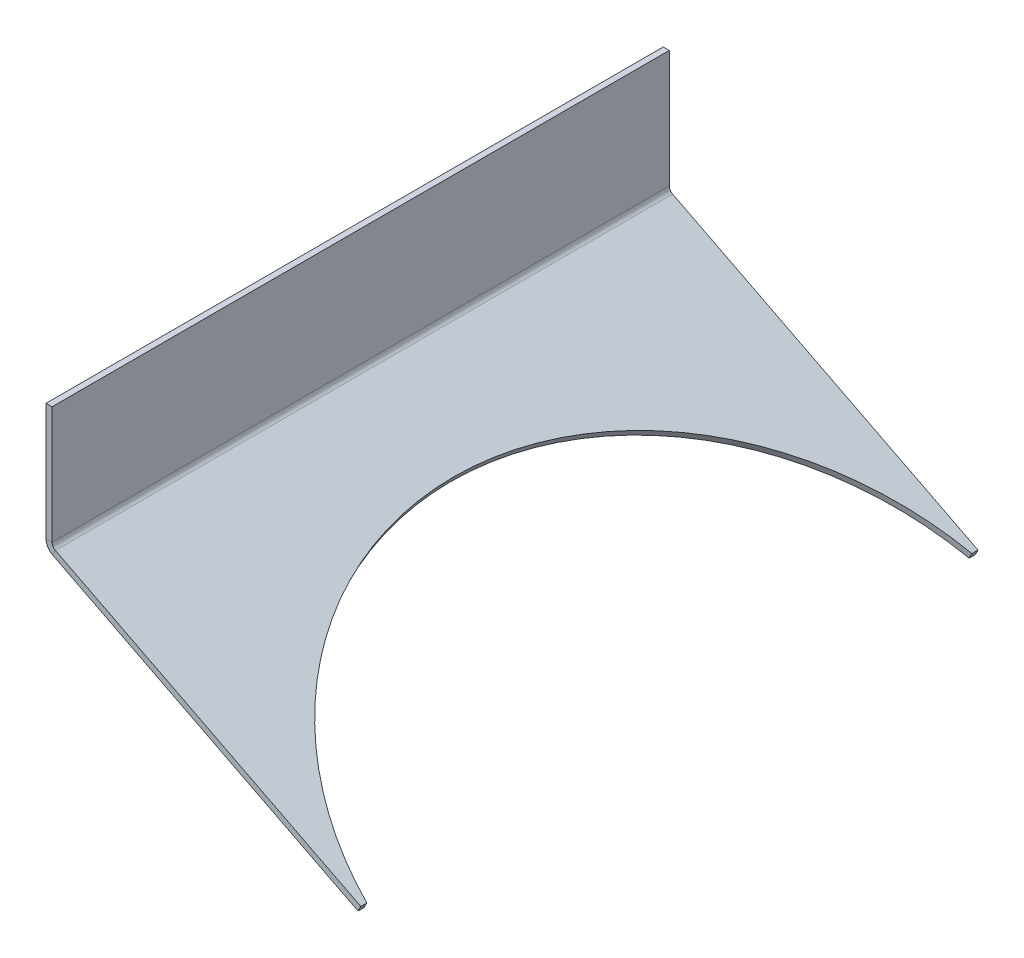
ISO-10303-21;
HEADER;
FILE_DESCRIPTION(('STEP AP214'),'2;1');
FILE_NAME('part.step','',(''),(''),'','','');
FILE_SCHEMA(('AUTOMOTIVE_DESIGN { 1 0 10303 214 1 1 1 1 }'));
ENDSEC;
DATA;
#1=APPLICATION_CONTEXT('core data for automotive mechanical design processes');
#2=APPLICATION_PROTOCOL_DEFINITION('international standard','automotive_design',2000,#1);
#3=PRODUCT_CONTEXT('',#1,'mechanical');
#4=PRODUCT('Part','Part','',(#3));
#5=PRODUCT_RELATED_PRODUCT_CATEGORY('part','',(#4));
#6=PRODUCT_DEFINITION_FORMATION('','',#4);
#7=PRODUCT_DEFINITION_CONTEXT('part definition',#1,'design');
#8=PRODUCT_DEFINITION('design','',#6,#7);
#9=PRODUCT_DEFINITION_SHAPE('','',#8);
#10=(LENGTH_UNIT() NAMED_UNIT(*) SI_UNIT(.MILLI.,.METRE.));
#11=(NAMED_UNIT(*) PLANE_ANGLE_UNIT() SI_UNIT($,.RADIAN.));
#12=(NAMED_UNIT(*) SI_UNIT($,.STERADIAN.) SOLID_ANGLE_UNIT());
#13=UNCERTAINTY_MEASURE_WITH_UNIT(LENGTH_MEASURE(1.E-05),#10,'distance_accuracy_value','');
#14=(GEOMETRIC_REPRESENTATION_CONTEXT(3) GLOBAL_UNCERTAINTY_ASSIGNED_CONTEXT((#13)) GLOBAL_UNIT_ASSIGNED_CONTEXT((#10,
#11,#12)) REPRESENTATION_CONTEXT('',''));
#15=CARTESIAN_POINT('',(0.,0.,0.));
#16=DIRECTION('',(0.,0.,1.));
#17=DIRECTION('',(1.,0.,0.));
#18=AXIS2_PLACEMENT_3D('',#15,#16,#17);
#19=CARTESIAN_POINT('',(1.49007185932733,344.725043581064,101.999999995405));
#20=DIRECTION('',(0.,-1.,0.));
#21=DIRECTION('',(0.,0.,-1.));
#22=AXIS2_PLACEMENT_3D('',#19,#20,#21);
#23=PLANE('',#22);
#24=DIRECTION('',(1.,0.,0.));
#25=VECTOR('',#24,1.);
#26=CARTESIAN_POINT('',(1.49007185932733,344.725043581064,-102.00000000458));
#27=LINE('',#26,#25);
#28=CARTESIAN_POINT('',(-0.509928140672666,344.725043581064,-102.00000000458));
#29=VERTEX_POINT('',#28);
#30=CARTESIAN_POINT('',(1.49007185932733,344.725043581064,-102.00000000458));
#31=VERTEX_POINT('',#30);
#32=EDGE_CURVE('E11',#29,#31,#27,.T.);
#33=ORIENTED_EDGE('',*,*,#32,.F.);
#34=DIRECTION('',(0.,0.,1.));
#35=VECTOR('',#34,1.);
#36=CARTESIAN_POINT('',(-0.509928140672666,344.725043581064,101.999999995405));
#37=LINE('',#36,#35);
#38=CARTESIAN_POINT('',(-0.509928140672666,344.725043581064,101.999999995405));
#39=VERTEX_POINT('',#38);
#40=EDGE_CURVE('E96',#39,#29,#37,.F.);
#41=ORIENTED_EDGE('',*,*,#40,.F.);
#42=DIRECTION('',(1.,0.,0.));
#43=VECTOR('',#42,1.);
#44=CARTESIAN_POINT('',(1.49007185932733,344.725043581064,101.999999995405));
#45=LINE('',#44,#43);
#46=CARTESIAN_POINT('',(1.49007185932733,344.725043581064,101.999999995405));
#47=VERTEX_POINT('',#46);
#48=EDGE_CURVE('E51',#39,#47,#45,.T.);
#49=ORIENTED_EDGE('',*,*,#48,.T.);
#50=DIRECTION('',(0.,0.,-1.));
#51=VECTOR('',#50,1.);
#52=CARTESIAN_POINT('',(1.49007185932733,344.725043581064,101.999999995405));
#53=LINE('',#52,#51);
#54=EDGE_CURVE('E98',#47,#31,#53,.T.);
#55=ORIENTED_EDGE('',*,*,#54,.T.);
#56=EDGE_LOOP('',(#33,#41,#49,#55));
#57=FACE_BOUND('',#56,.T.);
#58=ADVANCED_FACE('F41',(#57),#23,.F.);
#59=CARTESIAN_POINT('',(1.49007185932733,344.725043581064,101.999999995405));
#60=DIRECTION('',(0.,0.,1.));
#61=DIRECTION('',(0.,-1.,0.));
#62=AXIS2_PLACEMENT_3D('',#59,#60,#61);
#63=PLANE('',#62);
#64=ORIENTED_EDGE('',*,*,#48,.F.);
#65=DIRECTION('',(0.,1.,0.));
#66=VECTOR('',#65,1.);
#67=CARTESIAN_POINT('',(-0.509928140672666,344.725043581064,101.999999995405));
#68=LINE('',#67,#66);
#69=CARTESIAN_POINT('',(-0.50992814067266,305.950645157344,101.999999995405));
#70=VERTEX_POINT('',#69);
#71=EDGE_CURVE('E111',#39,#70,#68,.F.);
#72=ORIENTED_EDGE('',*,*,#71,.T.);
#73=DIRECTION('',(1.,0.,0.));
#74=VECTOR('',#73,1.);
#75=CARTESIAN_POINT('',(1.49007185932734,305.950645157344,101.999999995405));
#76=LINE('',#75,#74);
#77=CARTESIAN_POINT('',(1.49007185932734,305.950645157344,101.999999995405));
#78=VERTEX_POINT('',#77);
#79=EDGE_CURVE('E134',#70,#78,#76,.T.);
#80=ORIENTED_EDGE('',*,*,#79,.T.);
#81=DIRECTION('',(0.,-1.,0.));
#82=VECTOR('',#81,1.);
#83=CARTESIAN_POINT('',(1.49007185932733,344.725043581064,101.999999995405));
#84=LINE('',#83,#82);
#85=EDGE_CURVE('E146',#47,#78,#84,.T.);
#86=ORIENTED_EDGE('',*,*,#85,.F.);
#87=EDGE_LOOP('',(#64,#72,#80,#86));
#88=FACE_BOUND('',#87,.T.);
#89=ADVANCED_FACE('F150',(#88),#63,.T.);
#90=CARTESIAN_POINT('',(3.49007185932734,305.950645157344,101.999999995405));
#91=DIRECTION('',(0.,0.,1.));
#92=DIRECTION('',(1.,0.,0.));
#93=AXIS2_PLACEMENT_3D('',#90,#91,#92);
#94=PLANE('',#93);
#95=ORIENTED_EDGE('',*,*,#79,.F.);
#96=CARTESIAN_POINT('',(3.49007185932734,305.950645157344,101.999999995405));
#97=DIRECTION('',(0.,0.,-1.));
#98=DIRECTION('',(-1.,0.,0.));
#99=AXIS2_PLACEMENT_3D('',#96,#97,#98);
#100=CIRCLE('',#99,4.);
#101=CARTESIAN_POINT('',(1.67410986036918,302.38661906059,101.999999995405));
#102=VERTEX_POINT('',#101);
#103=EDGE_CURVE('E190',#70,#102,#100,.F.);
#104=ORIENTED_EDGE('',*,*,#103,.T.);
#105=DIRECTION('',(0.453990499739547,0.891006524188367,0.));
#106=VECTOR('',#105,1.);
#107=CARTESIAN_POINT('',(2.58209085984827,304.168632108967,101.999999995405));
#108=LINE('',#107,#106);
#109=CARTESIAN_POINT('',(2.58209085984827,304.168632108967,101.999999995405));
#110=VERTEX_POINT('',#109);
#111=EDGE_CURVE('E132',#102,#110,#108,.T.);
#112=ORIENTED_EDGE('',*,*,#111,.T.);
#113=CARTESIAN_POINT('',(3.49007185932734,305.950645157344,101.999999995405));
#114=DIRECTION('',(0.,0.,-1.));
#115=DIRECTION('',(-1.,0.,0.));
#116=AXIS2_PLACEMENT_3D('',#113,#114,#115);
#117=CIRCLE('',#116,2.);
#118=EDGE_CURVE('E176',#78,#110,#117,.F.);
#119=ORIENTED_EDGE('',*,*,#118,.F.);
#120=EDGE_LOOP('',(#95,#104,#112,#119));
#121=FACE_BOUND('',#120,.T.);
#122=ADVANCED_FACE('F209',(#121),#94,.T.);
#123=CARTESIAN_POINT('',(1.49007185932734,304.725043581064,101.999999995405));
#124=DIRECTION('',(0.,0.,1.));
#125=DIRECTION('',(0.891006524188367,-0.453990499739547,0.));
#126=AXIS2_PLACEMENT_3D('',#123,#124,#125);
#127=PLANE('',#126);
#128=ORIENTED_EDGE('',*,*,#111,.F.);
#129=DIRECTION('',(-0.891006524188368,0.453990499739548,0.));
#130=VECTOR('',#129,1.);
#131=CARTESIAN_POINT('',(0.582090859848245,302.943030532687,101.999999995405));
#132=LINE('',#131,#130);
#133=CARTESIAN_POINT('',(102.615356420228,250.95448503465,101.999999995405));
#134=VERTEX_POINT('',#133);
#135=EDGE_CURVE('E185',#102,#134,#132,.F.);
#136=ORIENTED_EDGE('',*,*,#135,.T.);
#137=DIRECTION('',(0.453990499739547,0.891006524188367,0.));
#138=VECTOR('',#137,1.);
#139=CARTESIAN_POINT('',(103.523337419707,252.736498083027,101.999999995405));
#140=LINE('',#139,#138);
#141=CARTESIAN_POINT('',(103.523337419707,252.736498083027,101.999999995405));
#142=VERTEX_POINT('',#141);
#143=EDGE_CURVE('E59',#134,#142,#140,.T.);
#144=ORIENTED_EDGE('',*,*,#143,.T.);
#145=DIRECTION('',(0.891006524188367,-0.453990499739547,0.));
#146=VECTOR('',#145,1.);
#147=CARTESIAN_POINT('',(1.49007185932734,304.725043581064,101.999999995405));
#148=LINE('',#147,#146);
#149=EDGE_CURVE('E171',#110,#142,#148,.T.);
#150=ORIENTED_EDGE('',*,*,#149,.F.);
#151=EDGE_LOOP('',(#128,#136,#144,#150));
#152=FACE_BOUND('',#151,.T.);
#153=ADVANCED_FACE('F253',(#152),#127,.T.);
#154=CARTESIAN_POINT('',(103.523337419707,252.736498083027,101.999999995405));
#155=DIRECTION('',(-0.891006524188368,0.453990499739548,0.));
#156=DIRECTION('',(0.,0.,1.));
#157=AXIS2_PLACEMENT_3D('',#154,#155,#156);
#158=PLANE('',#157);
#159=ORIENTED_EDGE('',*,*,#143,.F.);
#160=DIRECTION('',(0.,0.,1.));
#161=VECTOR('',#160,1.);
#162=CARTESIAN_POINT('',(102.615356420228,250.95448503465,101.999999995405));
#163=LINE('',#162,#161);
#164=CARTESIAN_POINT('',(102.615356420228,250.95448503465,99.9999999954047));
#165=VERTEX_POINT('',#164);
#166=EDGE_CURVE('E181',#165,#134,#163,.T.);
#167=ORIENTED_EDGE('',*,*,#166,.F.);
#168=DIRECTION('',(0.453990499739547,0.891006524188367,0.));
#169=VECTOR('',#168,1.);
#170=CARTESIAN_POINT('',(103.523337419708,252.736498083027,99.9999999954047));
#171=LINE('',#170,#169);
#172=CARTESIAN_POINT('',(103.523337419708,252.736498083027,99.9999999954047));
#173=VERTEX_POINT('',#172);
#174=EDGE_CURVE('E128',#165,#173,#171,.T.);
#175=ORIENTED_EDGE('',*,*,#174,.T.);
#176=DIRECTION('',(0.,0.,1.));
#177=VECTOR('',#176,1.);
#178=CARTESIAN_POINT('',(103.523337419707,252.736498083027,101.999999995405));
#179=LINE('',#178,#177);
#180=EDGE_CURVE('E153',#173,#142,#179,.T.);
#181=ORIENTED_EDGE('',*,*,#180,.T.);
#182=EDGE_LOOP('',(#159,#167,#175,#181));
#183=FACE_BOUND('',#182,.T.);
#184=ADVANCED_FACE('F256',(#183),#158,.F.);
#185=CARTESIAN_POINT('',(123.570984232144,242.521711829615,0.));
#186=DIRECTION('',(0.453990499739547,0.891006524188367,0.));
#187=DIRECTION('',(-0.891006524188368,0.453990499739548,0.));
#188=AXIS2_PLACEMENT_3D('',#185,#186,#187);
#189=CYLINDRICAL_SURFACE('',#188,102.5);
#190=ORIENTED_EDGE('',*,*,#174,.F.);
#191=CARTESIAN_POINT('',(122.663003232664,240.739698781239,0.));
#192=DIRECTION('',(0.453990499739547,0.891006524188367,0.));
#193=DIRECTION('',(-0.891006524188368,0.453990499739548,0.));
#194=AXIS2_PLACEMENT_3D('',#191,#192,#193);
#195=CIRCLE('',#194,102.5);
#196=CARTESIAN_POINT('',(102.615356420228,250.95448503465,-99.9999999954047));
#197=VERTEX_POINT('',#196);
#198=EDGE_CURVE('E196',#197,#165,#195,.T.);
#199=ORIENTED_EDGE('',*,*,#198,.F.);
#200=DIRECTION('',(0.453990499739547,0.891006524188367,0.));
#201=VECTOR('',#200,1.);
#202=CARTESIAN_POINT('',(103.523337419708,252.736498083027,-99.9999999954046));
#203=LINE('',#202,#201);
#204=CARTESIAN_POINT('',(103.523337419708,252.736498083027,-99.9999999954046));
#205=VERTEX_POINT('',#204);
#206=EDGE_CURVE('E125',#197,#205,#203,.T.);
#207=ORIENTED_EDGE('',*,*,#206,.T.);
#208=CARTESIAN_POINT('',(123.570984232144,242.521711829615,0.));
#209=DIRECTION('',(0.453990499739547,0.891006524188367,0.));
#210=DIRECTION('',(-0.891006524188368,0.453990499739548,0.));
#211=AXIS2_PLACEMENT_3D('',#208,#209,#210);
#212=CIRCLE('',#211,102.5);
#213=EDGE_CURVE('E159',#205,#173,#212,.T.);
#214=ORIENTED_EDGE('',*,*,#213,.T.);
#215=EDGE_LOOP('',(#190,#199,#207,#214));
#216=FACE_BOUND('',#215,.T.);
#217=ADVANCED_FACE('F259',(#216),#189,.F.);
#218=CARTESIAN_POINT('',(103.523337419707,252.736498083027,101.999999995405));
#219=DIRECTION('',(-0.891006524188368,0.453990499739548,0.));
#220=DIRECTION('',(0.,0.,1.));
#221=AXIS2_PLACEMENT_3D('',#218,#219,#220);
#222=PLANE('',#221);
#223=ORIENTED_EDGE('',*,*,#206,.F.);
#224=DIRECTION('',(0.,0.,1.));
#225=VECTOR('',#224,1.);
#226=CARTESIAN_POINT('',(102.615356420228,250.95448503465,101.999999995405));
#227=LINE('',#226,#225);
#228=CARTESIAN_POINT('',(102.615356420228,250.95448503465,-102.00000000458));
#229=VERTEX_POINT('',#228);
#230=EDGE_CURVE('E193',#229,#197,#227,.T.);
#231=ORIENTED_EDGE('',*,*,#230,.F.);
#232=DIRECTION('',(0.453990499739547,0.891006524188367,0.));
#233=VECTOR('',#232,1.);
#234=CARTESIAN_POINT('',(103.523337419707,252.736498083027,-102.00000000458));
#235=LINE('',#234,#233);
#236=CARTESIAN_POINT('',(103.523337419707,252.736498083027,-102.00000000458));
#237=VERTEX_POINT('',#236);
#238=EDGE_CURVE('E122',#229,#237,#235,.T.);
#239=ORIENTED_EDGE('',*,*,#238,.T.);
#240=DIRECTION('',(0.,0.,1.));
#241=VECTOR('',#240,1.);
#242=CARTESIAN_POINT('',(103.523337419707,252.736498083027,101.999999995405));
#243=LINE('',#242,#241);
#244=EDGE_CURVE('E162',#237,#205,#243,.T.);
#245=ORIENTED_EDGE('',*,*,#244,.T.);
#246=EDGE_LOOP('',(#223,#231,#239,#245));
#247=FACE_BOUND('',#246,.T.);
#248=ADVANCED_FACE('F241',(#247),#222,.F.);
#249=CARTESIAN_POINT('',(1.49007185932734,304.725043581064,-102.00000000458));
#250=DIRECTION('',(0.,0.,1.));
#251=DIRECTION('',(0.891006524188367,-0.453990499739547,0.));
#252=AXIS2_PLACEMENT_3D('',#249,#250,#251);
#253=PLANE('',#252);
#254=ORIENTED_EDGE('',*,*,#238,.F.);
#255=DIRECTION('',(-0.891006524188368,0.453990499739548,0.));
#256=VECTOR('',#255,1.);
#257=CARTESIAN_POINT('',(0.582090859848245,302.943030532687,-102.00000000458));
#258=LINE('',#257,#256);
#259=CARTESIAN_POINT('',(1.67410986036918,302.38661906059,-102.00000000458));
#260=VERTEX_POINT('',#259);
#261=EDGE_CURVE('E186',#260,#229,#258,.F.);
#262=ORIENTED_EDGE('',*,*,#261,.F.);
#263=DIRECTION('',(0.453990499739542,0.89100652418837,0.));
#264=VECTOR('',#263,1.);
#265=CARTESIAN_POINT('',(2.58209085984827,304.168632108967,-102.00000000458));
#266=LINE('',#265,#264);
#267=CARTESIAN_POINT('',(2.58209085984827,304.168632108967,-102.00000000458));
#268=VERTEX_POINT('',#267);
#269=EDGE_CURVE('E119',#260,#268,#266,.T.);
#270=ORIENTED_EDGE('',*,*,#269,.T.);
#271=DIRECTION('',(0.891006524188367,-0.453990499739547,0.));
#272=VECTOR('',#271,1.);
#273=CARTESIAN_POINT('',(1.49007185932734,304.725043581064,-102.00000000458));
#274=LINE('',#273,#272);
#275=EDGE_CURVE('E165',#268,#237,#274,.T.);
#276=ORIENTED_EDGE('',*,*,#275,.T.);
#277=EDGE_LOOP('',(#254,#262,#270,#276));
#278=FACE_BOUND('',#277,.T.);
#279=ADVANCED_FACE('F228',(#278),#253,.F.);
#280=CARTESIAN_POINT('',(3.49007185932734,305.950645157344,-102.00000000458));
#281=DIRECTION('',(0.,0.,1.));
#282=DIRECTION('',(1.,0.,0.));
#283=AXIS2_PLACEMENT_3D('',#280,#281,#282);
#284=PLANE('',#283);
#285=ORIENTED_EDGE('',*,*,#269,.F.);
#286=CARTESIAN_POINT('',(3.49007185932734,305.950645157344,-102.00000000458));
#287=DIRECTION('',(0.,0.,-1.));
#288=DIRECTION('',(-1.,0.,0.));
#289=AXIS2_PLACEMENT_3D('',#286,#287,#288);
#290=CIRCLE('',#289,4.);
#291=CARTESIAN_POINT('',(-0.509928140672659,305.950645157344,-102.00000000458));
#292=VERTEX_POINT('',#291);
#293=EDGE_CURVE('E187',#292,#260,#290,.F.);
#294=ORIENTED_EDGE('',*,*,#293,.F.);
#295=DIRECTION('',(1.,0.,0.));
#296=VECTOR('',#295,1.);
#297=CARTESIAN_POINT('',(1.49007185932734,305.950645157344,-102.00000000458));
#298=LINE('',#297,#296);
#299=CARTESIAN_POINT('',(1.49007185932734,305.950645157344,-102.00000000458));
#300=VERTEX_POINT('',#299);
#301=EDGE_CURVE('E45',#292,#300,#298,.T.);
#302=ORIENTED_EDGE('',*,*,#301,.T.);
#303=CARTESIAN_POINT('',(3.49007185932734,305.950645157344,-102.00000000458));
#304=DIRECTION('',(0.,0.,-1.));
#305=DIRECTION('',(-1.,0.,0.));
#306=AXIS2_PLACEMENT_3D('',#303,#304,#305);
#307=CIRCLE('',#306,2.);
#308=EDGE_CURVE('E173',#300,#268,#307,.F.);
#309=ORIENTED_EDGE('',*,*,#308,.T.);
#310=EDGE_LOOP('',(#285,#294,#302,#309));
#311=FACE_BOUND('',#310,.T.);
#312=ADVANCED_FACE('F234',(#311),#284,.F.);
#313=CARTESIAN_POINT('',(1.49007185932733,344.725043581064,-102.00000000458));
#314=DIRECTION('',(0.,0.,1.));
#315=DIRECTION('',(0.,-1.,0.));
#316=AXIS2_PLACEMENT_3D('',#313,#314,#315);
#317=PLANE('',#316);
#318=DIRECTION('',(0.,1.,0.));
#319=VECTOR('',#318,1.);
#320=CARTESIAN_POINT('',(-0.509928140672666,344.725043581064,-102.00000000458));
#321=LINE('',#320,#319);
#322=EDGE_CURVE('E108',#29,#292,#321,.F.);
#323=ORIENTED_EDGE('',*,*,#322,.F.);
#324=ORIENTED_EDGE('',*,*,#32,.T.);
#325=DIRECTION('',(0.,-1.,0.));
#326=VECTOR('',#325,1.);
#327=CARTESIAN_POINT('',(1.49007185932733,344.725043581064,-102.00000000458));
#328=LINE('',#327,#326);
#329=EDGE_CURVE('E148',#31,#300,#328,.T.);
#330=ORIENTED_EDGE('',*,*,#329,.T.);
#331=ORIENTED_EDGE('',*,*,#301,.F.);
#332=EDGE_LOOP('',(#323,#324,#330,#331));
#333=FACE_BOUND('',#332,.T.);
#334=ADVANCED_FACE('F43',(#333),#317,.F.);
#335=CARTESIAN_POINT('',(3.49007185932734,305.950645157344,101.999999995405));
#336=DIRECTION('',(0.,0.,-1.));
#337=DIRECTION('',(-1.,0.,0.));
#338=AXIS2_PLACEMENT_3D('',#335,#336,#337);
#339=CYLINDRICAL_SURFACE('',#338,2.);
#340=ORIENTED_EDGE('',*,*,#308,.F.);
#341=DIRECTION('',(0.,0.,-1.));
#342=VECTOR('',#341,1.);
#343=CARTESIAN_POINT('',(1.49007185932734,305.950645157344,101.999999995405));
#344=LINE('',#343,#342);
#345=EDGE_CURVE('E151',#78,#300,#344,.T.);
#346=ORIENTED_EDGE('',*,*,#345,.F.);
#347=ORIENTED_EDGE('',*,*,#118,.T.);
#348=DIRECTION('',(0.,0.,-1.));
#349=VECTOR('',#348,1.);
#350=CARTESIAN_POINT('',(2.58209085984827,304.168632108967,101.999999995405));
#351=LINE('',#350,#349);
#352=EDGE_CURVE('E168',#110,#268,#351,.T.);
#353=ORIENTED_EDGE('',*,*,#352,.T.);
#354=EDGE_LOOP('',(#340,#346,#347,#353));
#355=FACE_BOUND('',#354,.T.);
#356=ADVANCED_FACE('F216',(#355),#339,.F.);
#357=CARTESIAN_POINT('',(1.49007185932734,304.725043581064,101.999999995405));
#358=DIRECTION('',(0.453990499739547,0.891006524188367,0.));
#359=DIRECTION('',(-0.891006524188368,0.453990499739548,0.));
#360=AXIS2_PLACEMENT_3D('',#357,#358,#359);
#361=PLANE('',#360);
#362=ORIENTED_EDGE('',*,*,#180,.F.);
#363=ORIENTED_EDGE('',*,*,#213,.F.);
#364=ORIENTED_EDGE('',*,*,#244,.F.);
#365=ORIENTED_EDGE('',*,*,#275,.F.);
#366=ORIENTED_EDGE('',*,*,#352,.F.);
#367=ORIENTED_EDGE('',*,*,#149,.T.);
#368=EDGE_LOOP('',(#362,#363,#364,#365,#366,#367));
#369=FACE_BOUND('',#368,.T.);
#370=ADVANCED_FACE('F232',(#369),#361,.T.);
#371=CARTESIAN_POINT('',(1.49007185932733,344.725043581064,101.999999995405));
#372=DIRECTION('',(1.,0.,0.));
#373=DIRECTION('',(0.,1.,0.));
#374=AXIS2_PLACEMENT_3D('',#371,#372,#373);
#375=PLANE('',#374);
#376=ORIENTED_EDGE('',*,*,#329,.F.);
#377=ORIENTED_EDGE('',*,*,#54,.F.);
#378=ORIENTED_EDGE('',*,*,#85,.T.);
#379=ORIENTED_EDGE('',*,*,#345,.T.);
#380=EDGE_LOOP('',(#376,#377,#378,#379));
#381=FACE_BOUND('',#380,.T.);
#382=ADVANCED_FACE('F144',(#381),#375,.T.);
#383=CARTESIAN_POINT('',(3.49007185932734,305.950645157344,101.999999995405));
#384=DIRECTION('',(0.,0.,-1.));
#385=DIRECTION('',(-1.,0.,0.));
#386=AXIS2_PLACEMENT_3D('',#383,#384,#385);
#387=CYLINDRICAL_SURFACE('',#386,4.);
#388=ORIENTED_EDGE('',*,*,#293,.T.);
#389=DIRECTION('',(0.,0.,-1.));
#390=VECTOR('',#389,1.);
#391=CARTESIAN_POINT('',(1.67410986036917,302.38661906059,101.999999995405));
#392=LINE('',#391,#390);
#393=EDGE_CURVE('E182',#102,#260,#392,.T.);
#394=ORIENTED_EDGE('',*,*,#393,.F.);
#395=ORIENTED_EDGE('',*,*,#103,.F.);
#396=DIRECTION('',(0.,0.,1.));
#397=VECTOR('',#396,1.);
#398=CARTESIAN_POINT('',(-0.50992814067266,305.950645157344,101.999999995405));
#399=LINE('',#398,#397);
#400=EDGE_CURVE('E179',#70,#292,#399,.F.);
#401=ORIENTED_EDGE('',*,*,#400,.T.);
#402=EDGE_LOOP('',(#388,#394,#395,#401));
#403=FACE_BOUND('',#402,.T.);
#404=ADVANCED_FACE('F206',(#403),#387,.T.);
#405=CARTESIAN_POINT('',(0.582090859848245,302.943030532687,101.999999995405));
#406=DIRECTION('',(0.453990499739547,0.891006524188367,0.));
#407=DIRECTION('',(-0.891006524188368,0.453990499739548,0.));
#408=AXIS2_PLACEMENT_3D('',#405,#406,#407);
#409=PLANE('',#408);
#410=ORIENTED_EDGE('',*,*,#166,.T.);
#411=ORIENTED_EDGE('',*,*,#135,.F.);
#412=ORIENTED_EDGE('',*,*,#393,.T.);
#413=ORIENTED_EDGE('',*,*,#261,.T.);
#414=ORIENTED_EDGE('',*,*,#230,.T.);
#415=ORIENTED_EDGE('',*,*,#198,.T.);
#416=EDGE_LOOP('',(#410,#411,#412,#413,#414,#415));
#417=FACE_BOUND('',#416,.T.);
#418=ADVANCED_FACE('F271',(#417),#409,.F.);
#419=CARTESIAN_POINT('',(-0.509928140672666,344.725043581064,101.999999995405));
#420=DIRECTION('',(1.,0.,0.));
#421=DIRECTION('',(0.,1.,0.));
#422=AXIS2_PLACEMENT_3D('',#419,#420,#421);
#423=PLANE('',#422);
#424=ORIENTED_EDGE('',*,*,#322,.T.);
#425=ORIENTED_EDGE('',*,*,#400,.F.);
#426=ORIENTED_EDGE('',*,*,#71,.F.);
#427=ORIENTED_EDGE('',*,*,#40,.T.);
#428=EDGE_LOOP('',(#424,#425,#426,#427));
#429=FACE_BOUND('',#428,.T.);
#430=ADVANCED_FACE('F106',(#429),#423,.F.);
#431=CLOSED_SHELL('',(#58,#89,#122,#153,#184,#217,#248,#279,#312,#334,#356,#370,#382,#404,#418,#430));
#432=MANIFOLD_SOLID_BREP('B2',#431);
#433=ADVANCED_BREP_SHAPE_REPRESENTATION('',(#18,#432),#14);
#434=SHAPE_DEFINITION_REPRESENTATION(#9,#433);
ENDSEC;
END-ISO-10303-21;
